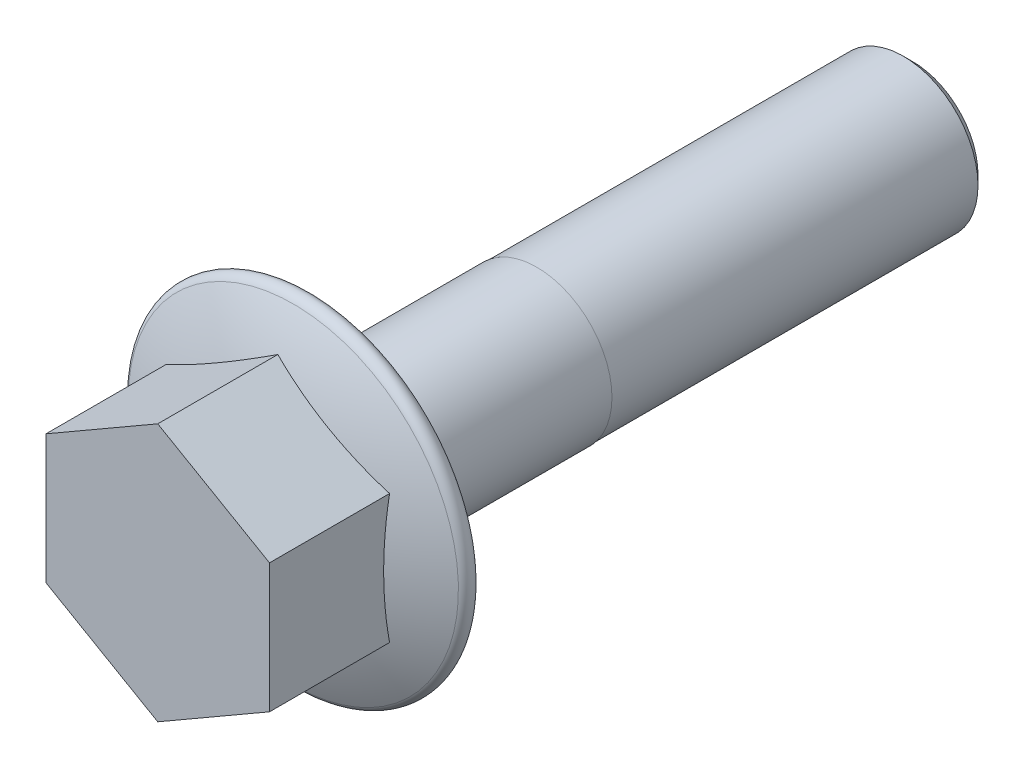
ISO-10303-21;
HEADER;
FILE_DESCRIPTION(('STEP AP214'),'2;1');
FILE_NAME('part.step','',(''),(''),'','','');
FILE_SCHEMA(('AUTOMOTIVE_DESIGN { 1 0 10303 214 1 1 1 1 }'));
ENDSEC;
DATA;
#1=APPLICATION_CONTEXT('core data for automotive mechanical design processes');
#2=APPLICATION_PROTOCOL_DEFINITION('international standard','automotive_design',2000,#1);
#3=PRODUCT_CONTEXT('',#1,'mechanical');
#4=PRODUCT('Part','Part','',(#3));
#5=PRODUCT_RELATED_PRODUCT_CATEGORY('part','',(#4));
#6=PRODUCT_DEFINITION_FORMATION('','',#4);
#7=PRODUCT_DEFINITION_CONTEXT('part definition',#1,'design');
#8=PRODUCT_DEFINITION('design','',#6,#7);
#9=PRODUCT_DEFINITION_SHAPE('','',#8);
#10=(LENGTH_UNIT() NAMED_UNIT(*) SI_UNIT(.MILLI.,.METRE.));
#11=(NAMED_UNIT(*) PLANE_ANGLE_UNIT() SI_UNIT($,.RADIAN.));
#12=(NAMED_UNIT(*) SI_UNIT($,.STERADIAN.) SOLID_ANGLE_UNIT());
#13=UNCERTAINTY_MEASURE_WITH_UNIT(LENGTH_MEASURE(1.E-05),#10,'distance_accuracy_value','');
#14=(GEOMETRIC_REPRESENTATION_CONTEXT(3) GLOBAL_UNCERTAINTY_ASSIGNED_CONTEXT((#13)) GLOBAL_UNIT_ASSIGNED_CONTEXT((#10,
#11,#12)) REPRESENTATION_CONTEXT('',''));
#15=CARTESIAN_POINT('',(0.,0.,0.));
#16=DIRECTION('',(0.,0.,1.));
#17=DIRECTION('',(1.,0.,0.));
#18=AXIS2_PLACEMENT_3D('',#15,#16,#17);
#19=CARTESIAN_POINT('',(0.,1.11022302462516E-13,-50.8));
#20=DIRECTION('',(0.,0.,1.));
#21=DIRECTION('',(1.,0.,0.));
#22=AXIS2_PLACEMENT_3D('',#19,#20,#21);
#23=CYLINDRICAL_SURFACE('',#22,6.35);
#24=CARTESIAN_POINT('',(0.,0.,0.));
#25=DIRECTION('',(0.,0.,-1.));
#26=DIRECTION('',(-1.,0.,0.));
#27=AXIS2_PLACEMENT_3D('',#24,#25,#26);
#28=CIRCLE('',#27,6.35);
#29=CARTESIAN_POINT('',(-6.35,0.,0.));
#30=VERTEX_POINT('',#29);
#31=EDGE_CURVE('E94',#30,#30,#28,.T.);
#32=ORIENTED_EDGE('',*,*,#31,.T.);
#33=EDGE_LOOP('',(#32));
#34=FACE_BOUND('',#33,.T.);
#35=CARTESIAN_POINT('',(0.,0.,-19.05));
#36=DIRECTION('',(0.,0.,1.));
#37=DIRECTION('',(1.,0.,0.));
#38=AXIS2_PLACEMENT_3D('',#35,#36,#37);
#39=CIRCLE('',#38,6.35);
#40=CARTESIAN_POINT('',(6.35,0.,-19.05));
#41=VERTEX_POINT('',#40);
#42=EDGE_CURVE('E209',#41,#41,#39,.T.);
#43=ORIENTED_EDGE('',*,*,#42,.T.);
#44=EDGE_LOOP('',(#43));
#45=FACE_BOUND('',#44,.T.);
#46=ADVANCED_FACE('F34',(#34,#45),#23,.T.);
#47=CARTESIAN_POINT('',(1.2490009027033E-13,10.8958697502006,0.));
#48=DIRECTION('',(0.,0.,-1.));
#49=DIRECTION('',(-1.,0.,0.));
#50=AXIS2_PLACEMENT_3D('',#47,#48,#49);
#51=PLANE('',#50);
#52=ORIENTED_EDGE('',*,*,#31,.F.);
#53=EDGE_LOOP('',(#52));
#54=FACE_BOUND('',#53,.T.);
#55=CARTESIAN_POINT('',(0.,0.,0.));
#56=DIRECTION('',(0.,0.,-1.));
#57=DIRECTION('',(-1.,0.,0.));
#58=AXIS2_PLACEMENT_3D('',#55,#56,#57);
#59=CIRCLE('',#58,13.589);
#60=CARTESIAN_POINT('',(-13.589,0.,0.));
#61=VERTEX_POINT('',#60);
#62=EDGE_CURVE('E206',#61,#61,#59,.T.);
#63=ORIENTED_EDGE('',*,*,#62,.T.);
#64=EDGE_LOOP('',(#63));
#65=FACE_BOUND('',#64,.T.);
#66=ADVANCED_FACE('F135',(#54,#65),#51,.T.);
#67=CARTESIAN_POINT('',(0.,0.,-26.69921));
#68=DIRECTION('',(0.,0.,-1.));
#69=DIRECTION('',(1.,0.,0.));
#70=AXIS2_PLACEMENT_3D('',#67,#68,#69);
#71=SPHERICAL_SURFACE('',#70,31.4617099999999);
#72=CARTESIAN_POINT('',(-4.71804999999978,8.17190231265041,-26.69921));
#73=DIRECTION('',(-0.500000000000004,0.866025403784436,0.));
#74=DIRECTION('',(-0.866025403784436,-0.500000000000004,0.));
#75=AXIS2_PLACEMENT_3D('',#72,#73,#74);
#76=CIRCLE('',#75,30.0133172594117);
#77=CARTESIAN_POINT('',(1.2490009027033E-13,10.8958697502006,2.81551884020392));
#78=VERTEX_POINT('',#77);
#79=CARTESIAN_POINT('',(-9.43609999999993,5.4479348751002,2.81551884020392));
#80=VERTEX_POINT('',#79);
#81=EDGE_CURVE('E49',#78,#80,#76,.F.);
#82=ORIENTED_EDGE('',*,*,#81,.F.);
#83=CARTESIAN_POINT('',(4.71805000000014,8.1719023126503,-26.69921));
#84=DIRECTION('',(0.500000000000006,0.866025403784435,0.));
#85=DIRECTION('',(-0.866025403784435,0.500000000000006,0.));
#86=AXIS2_PLACEMENT_3D('',#83,#84,#85);
#87=CIRCLE('',#86,30.0133172594117);
#88=CARTESIAN_POINT('',(9.43609999999993,5.44793487510042,2.81551884020392));
#89=VERTEX_POINT('',#88);
#90=EDGE_CURVE('E85',#89,#78,#87,.F.);
#91=ORIENTED_EDGE('',*,*,#90,.F.);
#92=CARTESIAN_POINT('',(9.43610000000006,2.22044604925031E-13,-26.69921));
#93=DIRECTION('',(1.,0.,0.));
#94=DIRECTION('',(0.,1.,0.));
#95=AXIS2_PLACEMENT_3D('',#92,#93,#94);
#96=CIRCLE('',#95,30.0133172594117);
#97=CARTESIAN_POINT('',(9.43610000000006,-5.4479348751002,2.81551884020392));
#98=VERTEX_POINT('',#97);
#99=EDGE_CURVE('E89',#98,#89,#96,.F.);
#100=ORIENTED_EDGE('',*,*,#99,.F.);
#101=CARTESIAN_POINT('',(4.71805000000003,-8.17190231265019,-26.69921));
#102=DIRECTION('',(0.499999999999998,-0.866025403784439,0.));
#103=DIRECTION('',(0.866025403784439,0.499999999999998,0.));
#104=AXIS2_PLACEMENT_3D('',#101,#102,#103);
#105=CIRCLE('',#104,30.0133172594116);
#106=CARTESIAN_POINT('',(0.,-10.8958697502003,2.81551884020392));
#107=VERTEX_POINT('',#106);
#108=EDGE_CURVE('E103',#107,#98,#105,.F.);
#109=ORIENTED_EDGE('',*,*,#108,.F.);
#110=CARTESIAN_POINT('',(-4.71804999999982,-8.1719023126503,-26.69921));
#111=DIRECTION('',(-0.499999999999995,-0.866025403784442,0.));
#112=DIRECTION('',(0.866025403784442,-0.499999999999995,0.));
#113=AXIS2_PLACEMENT_3D('',#110,#111,#112);
#114=CIRCLE('',#113,30.0133172594116);
#115=CARTESIAN_POINT('',(-9.43609999999996,-5.4479348751002,2.8155188402039));
#116=VERTEX_POINT('',#115);
#117=EDGE_CURVE('E197',#116,#107,#114,.F.);
#118=ORIENTED_EDGE('',*,*,#117,.F.);
#119=CARTESIAN_POINT('',(-9.43610000000006,-1.11022302462516E-13,-26.69921));
#120=DIRECTION('',(-1.,0.,0.));
#121=DIRECTION('',(0.,-1.,0.));
#122=AXIS2_PLACEMENT_3D('',#119,#120,#121);
#123=CIRCLE('',#122,30.0133172594116);
#124=EDGE_CURVE('E199',#80,#116,#123,.F.);
#125=ORIENTED_EDGE('',*,*,#124,.F.);
#126=EDGE_LOOP('',(#82,#91,#100,#109,#118,#125));
#127=FACE_BOUND('',#126,.T.);
#128=CARTESIAN_POINT('',(0.,0.,1.50532445751198));
#129=DIRECTION('',(0.,0.,-1.));
#130=DIRECTION('',(-1.,0.,0.));
#131=AXIS2_PLACEMENT_3D('',#128,#129,#130);
#132=CIRCLE('',#131,13.9407113218486);
#133=CARTESIAN_POINT('',(-13.9407113218486,0.,1.50532445751197));
#134=VERTEX_POINT('',#133);
#135=EDGE_CURVE('E104',#134,#134,#132,.T.);
#136=ORIENTED_EDGE('',*,*,#135,.F.);
#137=EDGE_LOOP('',(#136));
#138=FACE_BOUND('',#137,.T.);
#139=ADVANCED_FACE('F87',(#127,#138),#71,.T.);
#140=CARTESIAN_POINT('',(0.,0.,0.79375000000001));
#141=DIRECTION('',(0.,0.,-1.));
#142=DIRECTION('',(-1.,0.,0.));
#143=AXIS2_PLACEMENT_3D('',#140,#141,#142);
#144=TOROIDAL_SURFACE('',#143,13.589,0.793749999999961);
#145=ORIENTED_EDGE('',*,*,#135,.T.);
#146=EDGE_LOOP('',(#145));
#147=FACE_BOUND('',#146,.T.);
#148=ORIENTED_EDGE('',*,*,#62,.F.);
#149=EDGE_LOOP('',(#148));
#150=FACE_BOUND('',#149,.T.);
#151=ADVANCED_FACE('F148',(#147,#150),#144,.T.);
#152=CARTESIAN_POINT('',(0.,10.8958697502006,12.954));
#153=DIRECTION('',(0.,0.,-1.));
#154=DIRECTION('',(-1.,0.,0.));
#155=AXIS2_PLACEMENT_3D('',#152,#153,#154);
#156=PLANE('',#155);
#157=DIRECTION('',(0.866025403784436,0.500000000000004,0.));
#158=VECTOR('',#157,1.);
#159=CARTESIAN_POINT('',(-9.43609999999996,5.4479348751002,12.954));
#160=LINE('',#159,#158);
#161=CARTESIAN_POINT('',(-9.43609999999996,5.4479348751002,12.954));
#162=VERTEX_POINT('',#161);
#163=CARTESIAN_POINT('',(0.,10.8958697502006,12.954));
#164=VERTEX_POINT('',#163);
#165=EDGE_CURVE('E174',#162,#164,#160,.T.);
#166=ORIENTED_EDGE('',*,*,#165,.F.);
#167=DIRECTION('',(0.,1.,0.));
#168=VECTOR('',#167,1.);
#169=CARTESIAN_POINT('',(-9.43609999999999,-5.4479348751002,12.954));
#170=LINE('',#169,#168);
#171=CARTESIAN_POINT('',(-9.43609999999999,-5.4479348751002,12.954));
#172=VERTEX_POINT('',#171);
#173=EDGE_CURVE('E114',#172,#162,#170,.T.);
#174=ORIENTED_EDGE('',*,*,#173,.F.);
#175=DIRECTION('',(-0.866025403784442,0.499999999999995,0.));
#176=VECTOR('',#175,1.);
#177=CARTESIAN_POINT('',(0.,-10.8958697502003,12.954));
#178=LINE('',#177,#176);
#179=CARTESIAN_POINT('',(0.,-10.8958697502003,12.954));
#180=VERTEX_POINT('',#179);
#181=EDGE_CURVE('E187',#180,#172,#178,.T.);
#182=ORIENTED_EDGE('',*,*,#181,.F.);
#183=DIRECTION('',(-0.866025403784439,-0.499999999999998,0.));
#184=VECTOR('',#183,1.);
#185=CARTESIAN_POINT('',(9.43610000000003,-5.4479348751002,12.954));
#186=LINE('',#185,#184);
#187=CARTESIAN_POINT('',(9.43610000000003,-5.4479348751002,12.954));
#188=VERTEX_POINT('',#187);
#189=EDGE_CURVE('E180',#188,#180,#186,.T.);
#190=ORIENTED_EDGE('',*,*,#189,.F.);
#191=DIRECTION('',(0.,-1.,0.));
#192=VECTOR('',#191,1.);
#193=CARTESIAN_POINT('',(9.43609999999991,5.44793487510042,12.954));
#194=LINE('',#193,#192);
#195=CARTESIAN_POINT('',(9.43609999999991,5.44793487510042,12.954));
#196=VERTEX_POINT('',#195);
#197=EDGE_CURVE('E178',#196,#188,#194,.T.);
#198=ORIENTED_EDGE('',*,*,#197,.F.);
#199=DIRECTION('',(0.866025403784435,-0.500000000000006,0.));
#200=VECTOR('',#199,1.);
#201=CARTESIAN_POINT('',(0.,10.8958697502006,12.954));
#202=LINE('',#201,#200);
#203=EDGE_CURVE('E109',#164,#196,#202,.T.);
#204=ORIENTED_EDGE('',*,*,#203,.F.);
#205=EDGE_LOOP('',(#166,#174,#182,#190,#198,#204));
#206=FACE_BOUND('',#205,.T.);
#207=ADVANCED_FACE('F146',(#206),#156,.F.);
#208=CARTESIAN_POINT('',(0.,10.8958697502006,12.954));
#209=DIRECTION('',(0.500000000000006,0.866025403784435,0.));
#210=DIRECTION('',(-0.866025403784435,0.500000000000006,0.));
#211=AXIS2_PLACEMENT_3D('',#208,#209,#210);
#212=PLANE('',#211);
#213=DIRECTION('',(0.,0.,-1.));
#214=VECTOR('',#213,1.);
#215=CARTESIAN_POINT('',(9.43609999999991,5.44793487510042,12.954));
#216=LINE('',#215,#214);
#217=EDGE_CURVE('E100',#196,#89,#216,.T.);
#218=ORIENTED_EDGE('',*,*,#217,.T.);
#219=ORIENTED_EDGE('',*,*,#90,.T.);
#220=DIRECTION('',(0.,0.,-1.));
#221=VECTOR('',#220,1.);
#222=CARTESIAN_POINT('',(0.,10.8958697502006,12.954));
#223=LINE('',#222,#221);
#224=EDGE_CURVE('E110',#164,#78,#223,.T.);
#225=ORIENTED_EDGE('',*,*,#224,.F.);
#226=ORIENTED_EDGE('',*,*,#203,.T.);
#227=EDGE_LOOP('',(#218,#219,#225,#226));
#228=FACE_BOUND('',#227,.T.);
#229=ADVANCED_FACE('F107',(#228),#212,.T.);
#230=CARTESIAN_POINT('',(9.43609999999991,5.44793487510042,12.954));
#231=DIRECTION('',(1.,0.,0.));
#232=DIRECTION('',(0.,1.,0.));
#233=AXIS2_PLACEMENT_3D('',#230,#231,#232);
#234=PLANE('',#233);
#235=DIRECTION('',(0.,0.,-1.));
#236=VECTOR('',#235,1.);
#237=CARTESIAN_POINT('',(9.43610000000003,-5.4479348751002,12.954));
#238=LINE('',#237,#236);
#239=EDGE_CURVE('E102',#188,#98,#238,.T.);
#240=ORIENTED_EDGE('',*,*,#239,.T.);
#241=ORIENTED_EDGE('',*,*,#99,.T.);
#242=ORIENTED_EDGE('',*,*,#217,.F.);
#243=ORIENTED_EDGE('',*,*,#197,.T.);
#244=EDGE_LOOP('',(#240,#241,#242,#243));
#245=FACE_BOUND('',#244,.T.);
#246=ADVANCED_FACE('F98',(#245),#234,.T.);
#247=CARTESIAN_POINT('',(9.43610000000003,-5.4479348751002,12.954));
#248=DIRECTION('',(0.499999999999998,-0.866025403784439,0.));
#249=DIRECTION('',(0.866025403784439,0.499999999999998,0.));
#250=AXIS2_PLACEMENT_3D('',#247,#248,#249);
#251=PLANE('',#250);
#252=DIRECTION('',(0.,0.,-1.));
#253=VECTOR('',#252,1.);
#254=CARTESIAN_POINT('',(0.,-10.8958697502003,12.954));
#255=LINE('',#254,#253);
#256=EDGE_CURVE('E112',#180,#107,#255,.T.);
#257=ORIENTED_EDGE('',*,*,#256,.T.);
#258=ORIENTED_EDGE('',*,*,#108,.T.);
#259=ORIENTED_EDGE('',*,*,#239,.F.);
#260=ORIENTED_EDGE('',*,*,#189,.T.);
#261=EDGE_LOOP('',(#257,#258,#259,#260));
#262=FACE_BOUND('',#261,.T.);
#263=ADVANCED_FACE('F159',(#262),#251,.T.);
#264=CARTESIAN_POINT('',(0.,-10.8958697502003,12.954));
#265=DIRECTION('',(-0.499999999999995,-0.866025403784442,0.));
#266=DIRECTION('',(0.866025403784442,-0.499999999999995,0.));
#267=AXIS2_PLACEMENT_3D('',#264,#265,#266);
#268=PLANE('',#267);
#269=DIRECTION('',(0.,0.,-1.));
#270=VECTOR('',#269,1.);
#271=CARTESIAN_POINT('',(-9.43609999999999,-5.4479348751002,12.954));
#272=LINE('',#271,#270);
#273=EDGE_CURVE('E192',#172,#116,#272,.T.);
#274=ORIENTED_EDGE('',*,*,#273,.T.);
#275=ORIENTED_EDGE('',*,*,#117,.T.);
#276=ORIENTED_EDGE('',*,*,#256,.F.);
#277=ORIENTED_EDGE('',*,*,#181,.T.);
#278=EDGE_LOOP('',(#274,#275,#276,#277));
#279=FACE_BOUND('',#278,.T.);
#280=ADVANCED_FACE('F155',(#279),#268,.T.);
#281=CARTESIAN_POINT('',(-9.43609999999999,-5.4479348751002,12.954));
#282=DIRECTION('',(-1.,0.,0.));
#283=DIRECTION('',(0.,-1.,0.));
#284=AXIS2_PLACEMENT_3D('',#281,#282,#283);
#285=PLANE('',#284);
#286=DIRECTION('',(0.,0.,-1.));
#287=VECTOR('',#286,1.);
#288=CARTESIAN_POINT('',(-9.43609999999996,5.4479348751002,12.954));
#289=LINE('',#288,#287);
#290=EDGE_CURVE('E56',#162,#80,#289,.T.);
#291=ORIENTED_EDGE('',*,*,#290,.T.);
#292=ORIENTED_EDGE('',*,*,#124,.T.);
#293=ORIENTED_EDGE('',*,*,#273,.F.);
#294=ORIENTED_EDGE('',*,*,#173,.T.);
#295=EDGE_LOOP('',(#291,#292,#293,#294));
#296=FACE_BOUND('',#295,.T.);
#297=ADVANCED_FACE('F151',(#296),#285,.T.);
#298=CARTESIAN_POINT('',(-9.43609999999996,5.4479348751002,12.954));
#299=DIRECTION('',(-0.500000000000004,0.866025403784436,0.));
#300=DIRECTION('',(-0.866025403784436,-0.500000000000004,0.));
#301=AXIS2_PLACEMENT_3D('',#298,#299,#300);
#302=PLANE('',#301);
#303=ORIENTED_EDGE('',*,*,#224,.T.);
#304=ORIENTED_EDGE('',*,*,#81,.T.);
#305=ORIENTED_EDGE('',*,*,#290,.F.);
#306=ORIENTED_EDGE('',*,*,#165,.T.);
#307=EDGE_LOOP('',(#303,#304,#305,#306));
#308=FACE_BOUND('',#307,.T.);
#309=ADVANCED_FACE('F154',(#308),#302,.T.);
#310=CARTESIAN_POINT('',(0.,6.35000000000008,-19.05));
#311=DIRECTION('',(0.,0.,-1.));
#312=DIRECTION('',(-1.,0.,0.));
#313=AXIS2_PLACEMENT_3D('',#310,#311,#312);
#314=PLANE('',#313);
#315=CARTESIAN_POINT('',(0.,0.,-19.05));
#316=DIRECTION('',(0.,0.,1.));
#317=DIRECTION('',(1.,0.,0.));
#318=AXIS2_PLACEMENT_3D('',#315,#316,#317);
#319=CIRCLE('',#318,6.29999999999999);
#320=CARTESIAN_POINT('',(6.29999999999999,0.,-19.05));
#321=VERTEX_POINT('',#320);
#322=EDGE_CURVE('E212',#321,#321,#319,.T.);
#323=ORIENTED_EDGE('',*,*,#322,.T.);
#324=EDGE_LOOP('',(#323));
#325=FACE_BOUND('',#324,.T.);
#326=ORIENTED_EDGE('',*,*,#42,.F.);
#327=EDGE_LOOP('',(#326));
#328=FACE_BOUND('',#327,.T.);
#329=ADVANCED_FACE('F168',(#325,#328),#314,.T.);
#330=CARTESIAN_POINT('',(0.,0.,-21.5519356247289));
#331=DIRECTION('',(0.,0.,1.));
#332=DIRECTION('',(1.,0.,0.));
#333=AXIS2_PLACEMENT_3D('',#330,#331,#332);
#334=CYLINDRICAL_SURFACE('',#333,6.29999999999999);
#335=CARTESIAN_POINT('',(0.,1.11022302462516E-13,-50.00625));
#336=DIRECTION('',(0.,0.,1.));
#337=DIRECTION('',(1.,0.,0.));
#338=AXIS2_PLACEMENT_3D('',#335,#336,#337);
#339=CIRCLE('',#338,6.29999999999999);
#340=CARTESIAN_POINT('',(6.29999999999999,1.11022302462516E-13,-50.00625));
#341=VERTEX_POINT('',#340);
#342=EDGE_CURVE('E42',#341,#341,#339,.T.);
#343=ORIENTED_EDGE('',*,*,#342,.T.);
#344=EDGE_LOOP('',(#343));
#345=FACE_BOUND('',#344,.T.);
#346=ORIENTED_EDGE('',*,*,#322,.F.);
#347=EDGE_LOOP('',(#346));
#348=FACE_BOUND('',#347,.T.);
#349=ADVANCED_FACE('F122',(#345,#348),#334,.T.);
#350=CARTESIAN_POINT('',(0.,1.11022302462516E-13,-50.8));
#351=DIRECTION('',(0.,0.,1.));
#352=DIRECTION('',(1.,0.,0.));
#353=AXIS2_PLACEMENT_3D('',#350,#351,#352);
#354=PLANE('',#353);
#355=CARTESIAN_POINT('',(0.,1.11022302462516E-13,-50.8));
#356=DIRECTION('',(0.,0.,1.));
#357=DIRECTION('',(1.,0.,0.));
#358=AXIS2_PLACEMENT_3D('',#355,#356,#357);
#359=CIRCLE('',#358,5.50624999999999);
#360=CARTESIAN_POINT('',(5.50624999999999,1.11022302462516E-13,-50.8));
#361=VERTEX_POINT('',#360);
#362=EDGE_CURVE('E11',#361,#361,#359,.F.);
#363=ORIENTED_EDGE('',*,*,#362,.T.);
#364=EDGE_LOOP('',(#363));
#365=FACE_BOUND('',#364,.T.);
#366=ADVANCED_FACE('F126',(#365),#354,.F.);
#367=CARTESIAN_POINT('',(0.,1.11022302462516E-13,-50.00625));
#368=DIRECTION('',(0.,0.,1.));
#369=DIRECTION('',(1.,0.,0.));
#370=AXIS2_PLACEMENT_3D('',#367,#368,#369);
#371=CONICAL_SURFACE('',#370,6.29999999999999,0.785398163397447);
#372=ORIENTED_EDGE('',*,*,#362,.F.);
#373=EDGE_LOOP('',(#372));
#374=FACE_BOUND('',#373,.T.);
#375=ORIENTED_EDGE('',*,*,#342,.F.);
#376=EDGE_LOOP('',(#375));
#377=FACE_BOUND('',#376,.T.);
#378=ADVANCED_FACE('F36',(#374,#377),#371,.T.);
#379=CLOSED_SHELL('',(#46,#66,#139,#151,#207,#229,#246,#263,#280,#297,#309,#329,#349,#366,#378));
#380=MANIFOLD_SOLID_BREP('B2',#379);
#381=ADVANCED_BREP_SHAPE_REPRESENTATION('',(#18,#380),#14);
#382=SHAPE_DEFINITION_REPRESENTATION(#9,#381);
ENDSEC;
END-ISO-10303-21;
